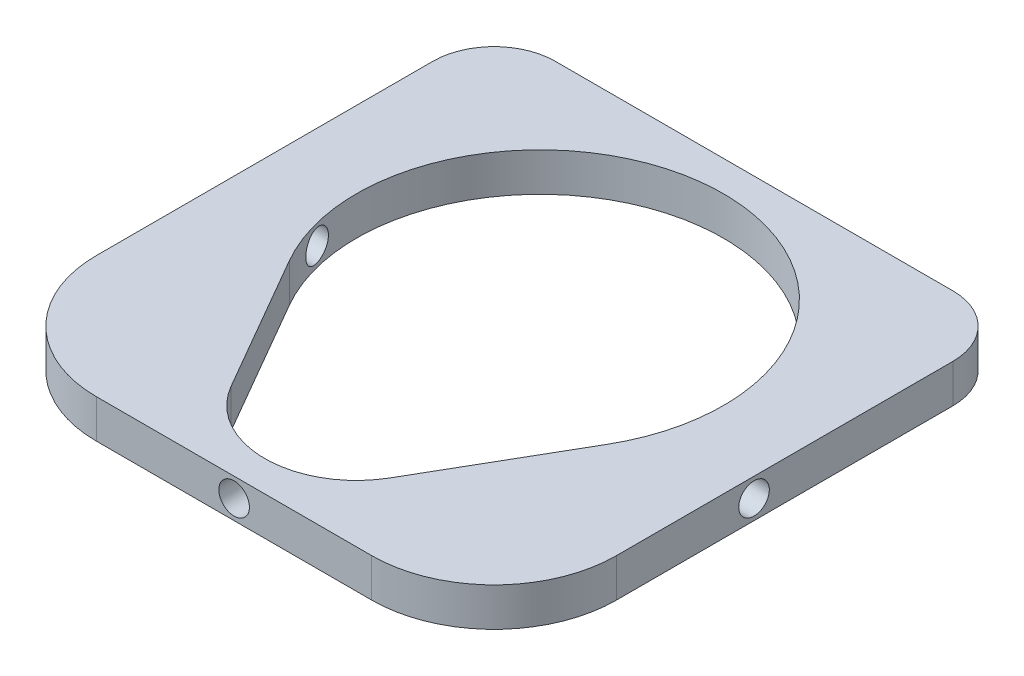
ISO-10303-21;
HEADER;
FILE_DESCRIPTION(('STEP AP214'),'2;1');
FILE_NAME('part.step','',(''),(''),'','','');
FILE_SCHEMA(('AUTOMOTIVE_DESIGN { 1 0 10303 214 1 1 1 1 }'));
ENDSEC;
DATA;
#1=APPLICATION_CONTEXT('core data for automotive mechanical design processes');
#2=APPLICATION_PROTOCOL_DEFINITION('international standard','automotive_design',2000,#1);
#3=PRODUCT_CONTEXT('',#1,'mechanical');
#4=PRODUCT('Part','Part','',(#3));
#5=PRODUCT_RELATED_PRODUCT_CATEGORY('part','',(#4));
#6=PRODUCT_DEFINITION_FORMATION('','',#4);
#7=PRODUCT_DEFINITION_CONTEXT('part definition',#1,'design');
#8=PRODUCT_DEFINITION('design','',#6,#7);
#9=PRODUCT_DEFINITION_SHAPE('','',#8);
#10=(LENGTH_UNIT() NAMED_UNIT(*) SI_UNIT(.MILLI.,.METRE.));
#11=(NAMED_UNIT(*) PLANE_ANGLE_UNIT() SI_UNIT($,.RADIAN.));
#12=(NAMED_UNIT(*) SI_UNIT($,.STERADIAN.) SOLID_ANGLE_UNIT());
#13=UNCERTAINTY_MEASURE_WITH_UNIT(LENGTH_MEASURE(1.E-05),#10,'distance_accuracy_value','');
#14=(GEOMETRIC_REPRESENTATION_CONTEXT(3) GLOBAL_UNCERTAINTY_ASSIGNED_CONTEXT((#13)) GLOBAL_UNIT_ASSIGNED_CONTEXT((#10,
#11,#12)) REPRESENTATION_CONTEXT('',''));
#15=CARTESIAN_POINT('',(0.,0.,0.));
#16=DIRECTION('',(0.,0.,1.));
#17=DIRECTION('',(1.,0.,0.));
#18=AXIS2_PLACEMENT_3D('',#15,#16,#17);
#19=CARTESIAN_POINT('',(0.,6.3,0.));
#20=DIRECTION('',(1.,0.,0.));
#21=DIRECTION('',(0.,0.,-1.));
#22=AXIS2_PLACEMENT_3D('',#19,#20,#21);
#23=PLANE('',#22);
#24=CARTESIAN_POINT('',(0.,3.15,-42.5));
#25=DIRECTION('',(-1.,0.,0.));
#26=DIRECTION('',(0.,0.,1.));
#27=AXIS2_PLACEMENT_3D('',#24,#25,#26);
#28=CIRCLE('',#27,2.5);
#29=CARTESIAN_POINT('',(0.,3.15,-40.));
#30=VERTEX_POINT('',#29);
#31=EDGE_CURVE('E223',#30,#30,#28,.T.);
#32=ORIENTED_EDGE('',*,*,#31,.F.);
#33=EDGE_LOOP('',(#32));
#34=FACE_BOUND('',#33,.T.);
#35=DIRECTION('',(0.,0.,1.));
#36=VECTOR('',#35,1.);
#37=CARTESIAN_POINT('',(0.,6.3,0.));
#38=LINE('',#37,#36);
#39=CARTESIAN_POINT('',(0.,6.3,-75.));
#40=VERTEX_POINT('',#39);
#41=CARTESIAN_POINT('',(0.,6.3,-20.));
#42=VERTEX_POINT('',#41);
#43=EDGE_CURVE('E160',#40,#42,#38,.T.);
#44=ORIENTED_EDGE('',*,*,#43,.F.);
#45=DIRECTION('',(0.,-1.,0.));
#46=VECTOR('',#45,1.);
#47=CARTESIAN_POINT('',(0.,6.3,-75.));
#48=LINE('',#47,#46);
#49=CARTESIAN_POINT('',(0.,0.,-75.));
#50=VERTEX_POINT('',#49);
#51=EDGE_CURVE('E11',#40,#50,#48,.T.);
#52=ORIENTED_EDGE('',*,*,#51,.T.);
#53=DIRECTION('',(0.,0.,1.));
#54=VECTOR('',#53,1.);
#55=CARTESIAN_POINT('',(0.,0.,0.));
#56=LINE('',#55,#54);
#57=CARTESIAN_POINT('',(0.,0.,-20.));
#58=VERTEX_POINT('',#57);
#59=EDGE_CURVE('E157',#50,#58,#56,.T.);
#60=ORIENTED_EDGE('',*,*,#59,.T.);
#61=DIRECTION('',(0.,-1.,0.));
#62=VECTOR('',#61,1.);
#63=CARTESIAN_POINT('',(0.,6.3,-20.));
#64=LINE('',#63,#62);
#65=EDGE_CURVE('E252',#58,#42,#64,.F.);
#66=ORIENTED_EDGE('',*,*,#65,.T.);
#67=EDGE_LOOP('',(#44,#52,#60,#66));
#68=FACE_BOUND('',#67,.T.);
#69=ADVANCED_FACE('F33',(#34,#68),#23,.F.);
#70=CARTESIAN_POINT('',(0.,6.3,0.));
#71=DIRECTION('',(0.,0.,-1.));
#72=DIRECTION('',(-1.,0.,0.));
#73=AXIS2_PLACEMENT_3D('',#70,#71,#72);
#74=PLANE('',#73);
#75=CARTESIAN_POINT('',(42.5,3.15,0.));
#76=DIRECTION('',(0.,0.,1.));
#77=DIRECTION('',(1.,0.,0.));
#78=AXIS2_PLACEMENT_3D('',#75,#76,#77);
#79=CIRCLE('',#78,2.5);
#80=CARTESIAN_POINT('',(45.,3.15,0.));
#81=VERTEX_POINT('',#80);
#82=EDGE_CURVE('E222',#81,#81,#79,.T.);
#83=ORIENTED_EDGE('',*,*,#82,.F.);
#84=EDGE_LOOP('',(#83));
#85=FACE_BOUND('',#84,.T.);
#86=DIRECTION('',(1.,0.,0.));
#87=VECTOR('',#86,1.);
#88=CARTESIAN_POINT('',(0.,0.,0.));
#89=LINE('',#88,#87);
#90=CARTESIAN_POINT('',(20.,0.,0.));
#91=VERTEX_POINT('',#90);
#92=CARTESIAN_POINT('',(65.,0.,0.));
#93=VERTEX_POINT('',#92);
#94=EDGE_CURVE('E172',#91,#93,#89,.T.);
#95=ORIENTED_EDGE('',*,*,#94,.T.);
#96=DIRECTION('',(0.,-1.,0.));
#97=VECTOR('',#96,1.);
#98=CARTESIAN_POINT('',(65.,6.3,0.));
#99=LINE('',#98,#97);
#100=CARTESIAN_POINT('',(65.,6.3,0.));
#101=VERTEX_POINT('',#100);
#102=EDGE_CURVE('E295',#93,#101,#99,.F.);
#103=ORIENTED_EDGE('',*,*,#102,.T.);
#104=DIRECTION('',(1.,0.,0.));
#105=VECTOR('',#104,1.);
#106=CARTESIAN_POINT('',(0.,6.3,0.));
#107=LINE('',#106,#105);
#108=CARTESIAN_POINT('',(20.,6.3,0.));
#109=VERTEX_POINT('',#108);
#110=EDGE_CURVE('E162',#109,#101,#107,.T.);
#111=ORIENTED_EDGE('',*,*,#110,.F.);
#112=DIRECTION('',(0.,-1.,0.));
#113=VECTOR('',#112,1.);
#114=CARTESIAN_POINT('',(20.,6.3,0.));
#115=LINE('',#114,#113);
#116=EDGE_CURVE('E301',#109,#91,#115,.T.);
#117=ORIENTED_EDGE('',*,*,#116,.T.);
#118=EDGE_LOOP('',(#95,#103,#111,#117));
#119=FACE_BOUND('',#118,.T.);
#120=ADVANCED_FACE('F275',(#85,#119),#74,.F.);
#121=CARTESIAN_POINT('',(85.,6.3,0.));
#122=DIRECTION('',(-1.,0.,0.));
#123=DIRECTION('',(0.,0.,1.));
#124=AXIS2_PLACEMENT_3D('',#121,#122,#123);
#125=PLANE('',#124);
#126=CARTESIAN_POINT('',(85.,3.15,-42.5));
#127=DIRECTION('',(-1.,0.,0.));
#128=DIRECTION('',(0.,0.,1.));
#129=AXIS2_PLACEMENT_3D('',#126,#127,#128);
#130=CIRCLE('',#129,2.5);
#131=CARTESIAN_POINT('',(85.,3.15,-40.));
#132=VERTEX_POINT('',#131);
#133=EDGE_CURVE('E194',#132,#132,#130,.T.);
#134=ORIENTED_EDGE('',*,*,#133,.T.);
#135=EDGE_LOOP('',(#134));
#136=FACE_BOUND('',#135,.T.);
#137=DIRECTION('',(0.,0.,-1.));
#138=VECTOR('',#137,1.);
#139=CARTESIAN_POINT('',(85.,0.,0.));
#140=LINE('',#139,#138);
#141=CARTESIAN_POINT('',(85.,0.,-20.));
#142=VERTEX_POINT('',#141);
#143=CARTESIAN_POINT('',(85.,0.,-75.));
#144=VERTEX_POINT('',#143);
#145=EDGE_CURVE('E175',#142,#144,#140,.T.);
#146=ORIENTED_EDGE('',*,*,#145,.T.);
#147=DIRECTION('',(0.,-1.,0.));
#148=VECTOR('',#147,1.);
#149=CARTESIAN_POINT('',(85.,6.3,-75.));
#150=LINE('',#149,#148);
#151=CARTESIAN_POINT('',(85.,6.3,-75.));
#152=VERTEX_POINT('',#151);
#153=EDGE_CURVE('E56',#144,#152,#150,.F.);
#154=ORIENTED_EDGE('',*,*,#153,.T.);
#155=DIRECTION('',(0.,0.,-1.));
#156=VECTOR('',#155,1.);
#157=CARTESIAN_POINT('',(85.,6.3,0.));
#158=LINE('',#157,#156);
#159=CARTESIAN_POINT('',(85.,6.3,-20.));
#160=VERTEX_POINT('',#159);
#161=EDGE_CURVE('E166',#160,#152,#158,.T.);
#162=ORIENTED_EDGE('',*,*,#161,.F.);
#163=DIRECTION('',(0.,-1.,0.));
#164=VECTOR('',#163,1.);
#165=CARTESIAN_POINT('',(85.,6.3,-20.));
#166=LINE('',#165,#164);
#167=EDGE_CURVE('E185',#160,#142,#166,.T.);
#168=ORIENTED_EDGE('',*,*,#167,.T.);
#169=EDGE_LOOP('',(#146,#154,#162,#168));
#170=FACE_BOUND('',#169,.T.);
#171=ADVANCED_FACE('F281',(#136,#170),#125,.F.);
#172=CARTESIAN_POINT('',(0.,6.3,-85.));
#173=DIRECTION('',(0.,0.,1.));
#174=DIRECTION('',(1.,0.,0.));
#175=AXIS2_PLACEMENT_3D('',#172,#173,#174);
#176=PLANE('',#175);
#177=DIRECTION('',(-1.,0.,0.));
#178=VECTOR('',#177,1.);
#179=CARTESIAN_POINT('',(0.,6.3,-85.));
#180=LINE('',#179,#178);
#181=CARTESIAN_POINT('',(75.,6.3,-85.));
#182=VERTEX_POINT('',#181);
#183=CARTESIAN_POINT('',(10.,6.3,-85.));
#184=VERTEX_POINT('',#183);
#185=EDGE_CURVE('E168',#182,#184,#180,.T.);
#186=ORIENTED_EDGE('',*,*,#185,.F.);
#187=DIRECTION('',(0.,-1.,0.));
#188=VECTOR('',#187,1.);
#189=CARTESIAN_POINT('',(75.,6.3,-85.));
#190=LINE('',#189,#188);
#191=CARTESIAN_POINT('',(75.,0.,-85.));
#192=VERTEX_POINT('',#191);
#193=EDGE_CURVE('E249',#182,#192,#190,.T.);
#194=ORIENTED_EDGE('',*,*,#193,.T.);
#195=DIRECTION('',(-1.,0.,0.));
#196=VECTOR('',#195,1.);
#197=CARTESIAN_POINT('',(0.,0.,-85.));
#198=LINE('',#197,#196);
#199=CARTESIAN_POINT('',(10.,0.,-85.));
#200=VERTEX_POINT('',#199);
#201=EDGE_CURVE('E163',#192,#200,#198,.T.);
#202=ORIENTED_EDGE('',*,*,#201,.T.);
#203=DIRECTION('',(0.,-1.,0.));
#204=VECTOR('',#203,1.);
#205=CARTESIAN_POINT('',(10.,6.3,-85.));
#206=LINE('',#205,#204);
#207=EDGE_CURVE('E247',#200,#184,#206,.F.);
#208=ORIENTED_EDGE('',*,*,#207,.T.);
#209=EDGE_LOOP('',(#186,#194,#202,#208));
#210=FACE_BOUND('',#209,.T.);
#211=ADVANCED_FACE('F246',(#210),#176,.F.);
#212=CARTESIAN_POINT('',(0.,6.3,0.));
#213=DIRECTION('',(0.,-1.,0.));
#214=DIRECTION('',(0.,0.,-1.));
#215=AXIS2_PLACEMENT_3D('',#212,#213,#214);
#216=PLANE('',#215);
#217=DIRECTION('',(0.5,0.,0.866025403784438));
#218=VECTOR('',#217,1.);
#219=CARTESIAN_POINT('',(16.5192378864669,6.3,-35.));
#220=LINE('',#219,#218);
#221=CARTESIAN_POINT('',(16.5192378864669,6.3,-35.));
#222=VERTEX_POINT('',#221);
#223=CARTESIAN_POINT('',(29.5096189432334,6.3,-12.5));
#224=VERTEX_POINT('',#223);
#225=EDGE_CURVE('E141',#222,#224,#220,.T.);
#226=ORIENTED_EDGE('',*,*,#225,.F.);
#227=CARTESIAN_POINT('',(42.5,6.3,-50.));
#228=DIRECTION('',(0.,1.,0.));
#229=DIRECTION('',(0.,0.,1.));
#230=AXIS2_PLACEMENT_3D('',#227,#228,#229);
#231=CIRCLE('',#230,30.);
#232=CARTESIAN_POINT('',(68.4807621135332,6.3,-35.));
#233=VERTEX_POINT('',#232);
#234=EDGE_CURVE('E146',#233,#222,#231,.T.);
#235=ORIENTED_EDGE('',*,*,#234,.F.);
#236=DIRECTION('',(0.5,0.,-0.866025403784439));
#237=VECTOR('',#236,1.);
#238=CARTESIAN_POINT('',(55.4903810567666,6.3,-12.5));
#239=LINE('',#238,#237);
#240=CARTESIAN_POINT('',(55.4903810567666,6.3,-12.5));
#241=VERTEX_POINT('',#240);
#242=EDGE_CURVE('E150',#241,#233,#239,.T.);
#243=ORIENTED_EDGE('',*,*,#242,.F.);
#244=CARTESIAN_POINT('',(42.5,6.3,-20.));
#245=DIRECTION('',(0.,1.,0.));
#246=DIRECTION('',(0.,0.,1.));
#247=AXIS2_PLACEMENT_3D('',#244,#245,#246);
#248=CIRCLE('',#247,15.);
#249=EDGE_CURVE('E130',#224,#241,#248,.T.);
#250=ORIENTED_EDGE('',*,*,#249,.F.);
#251=EDGE_LOOP('',(#226,#235,#243,#250));
#252=FACE_BOUND('',#251,.T.);
#253=ORIENTED_EDGE('',*,*,#161,.T.);
#254=CARTESIAN_POINT('',(75.,6.3,-75.));
#255=DIRECTION('',(0.,-1.,0.));
#256=DIRECTION('',(0.,0.,-1.));
#257=AXIS2_PLACEMENT_3D('',#254,#255,#256);
#258=CIRCLE('',#257,10.);
#259=EDGE_CURVE('E41',#152,#182,#258,.F.);
#260=ORIENTED_EDGE('',*,*,#259,.T.);
#261=ORIENTED_EDGE('',*,*,#185,.T.);
#262=CARTESIAN_POINT('',(10.,6.3,-75.));
#263=DIRECTION('',(0.,-1.,0.));
#264=DIRECTION('',(0.,0.,-1.));
#265=AXIS2_PLACEMENT_3D('',#262,#263,#264);
#266=CIRCLE('',#265,10.);
#267=EDGE_CURVE('E48',#184,#40,#266,.F.);
#268=ORIENTED_EDGE('',*,*,#267,.T.);
#269=ORIENTED_EDGE('',*,*,#43,.T.);
#270=CARTESIAN_POINT('',(20.,6.3,-20.));
#271=DIRECTION('',(0.,-1.,0.));
#272=DIRECTION('',(0.,0.,-1.));
#273=AXIS2_PLACEMENT_3D('',#270,#271,#272);
#274=CIRCLE('',#273,20.);
#275=EDGE_CURVE('E297',#42,#109,#274,.F.);
#276=ORIENTED_EDGE('',*,*,#275,.T.);
#277=ORIENTED_EDGE('',*,*,#110,.T.);
#278=CARTESIAN_POINT('',(65.,6.3,-20.));
#279=DIRECTION('',(0.,-1.,0.));
#280=DIRECTION('',(0.,0.,-1.));
#281=AXIS2_PLACEMENT_3D('',#278,#279,#280);
#282=CIRCLE('',#281,20.);
#283=EDGE_CURVE('E256',#101,#160,#282,.F.);
#284=ORIENTED_EDGE('',*,*,#283,.T.);
#285=EDGE_LOOP('',(#253,#260,#261,#268,#269,#276,#277,#284));
#286=FACE_BOUND('',#285,.T.);
#287=ADVANCED_FACE('F148',(#252,#286),#216,.F.);
#288=CARTESIAN_POINT('',(0.,0.,0.));
#289=DIRECTION('',(0.,-1.,0.));
#290=DIRECTION('',(0.,0.,-1.));
#291=AXIS2_PLACEMENT_3D('',#288,#289,#290);
#292=PLANE('',#291);
#293=CARTESIAN_POINT('',(42.5,0.,-50.));
#294=DIRECTION('',(0.,-1.,0.));
#295=DIRECTION('',(0.,0.,-1.));
#296=AXIS2_PLACEMENT_3D('',#293,#294,#295);
#297=CIRCLE('',#296,30.);
#298=CARTESIAN_POINT('',(16.5192378864669,0.,-35.));
#299=VERTEX_POINT('',#298);
#300=CARTESIAN_POINT('',(68.4807621135332,0.,-35.));
#301=VERTEX_POINT('',#300);
#302=EDGE_CURVE('E183',#299,#301,#297,.T.);
#303=ORIENTED_EDGE('',*,*,#302,.F.);
#304=DIRECTION('',(-0.5,0.,-0.866025403784438));
#305=VECTOR('',#304,1.);
#306=CARTESIAN_POINT('',(27.5448729810778,0.,-15.9030398304193));
#307=LINE('',#306,#305);
#308=CARTESIAN_POINT('',(29.5096189432334,0.,-12.5));
#309=VERTEX_POINT('',#308);
#310=EDGE_CURVE('E170',#309,#299,#307,.T.);
#311=ORIENTED_EDGE('',*,*,#310,.F.);
#312=CARTESIAN_POINT('',(42.5,0.,-20.));
#313=DIRECTION('',(0.,-1.,0.));
#314=DIRECTION('',(0.,0.,-1.));
#315=AXIS2_PLACEMENT_3D('',#312,#313,#314);
#316=CIRCLE('',#315,15.);
#317=CARTESIAN_POINT('',(55.4903810567666,0.,-12.5));
#318=VERTEX_POINT('',#317);
#319=EDGE_CURVE('E133',#318,#309,#316,.T.);
#320=ORIENTED_EDGE('',*,*,#319,.F.);
#321=DIRECTION('',(-0.5,0.,0.866025403784439));
#322=VECTOR('',#321,1.);
#323=CARTESIAN_POINT('',(36.2051270189222,0.,20.9030398304193));
#324=LINE('',#323,#322);
#325=EDGE_CURVE('E181',#301,#318,#324,.T.);
#326=ORIENTED_EDGE('',*,*,#325,.F.);
#327=EDGE_LOOP('',(#303,#311,#320,#326));
#328=FACE_BOUND('',#327,.T.);
#329=ORIENTED_EDGE('',*,*,#201,.F.);
#330=CARTESIAN_POINT('',(75.,0.,-75.));
#331=DIRECTION('',(0.,-1.,0.));
#332=DIRECTION('',(0.,0.,-1.));
#333=AXIS2_PLACEMENT_3D('',#330,#331,#332);
#334=CIRCLE('',#333,10.);
#335=EDGE_CURVE('E239',#192,#144,#334,.T.);
#336=ORIENTED_EDGE('',*,*,#335,.T.);
#337=ORIENTED_EDGE('',*,*,#145,.F.);
#338=CARTESIAN_POINT('',(65.,0.,-20.));
#339=DIRECTION('',(0.,-1.,0.));
#340=DIRECTION('',(0.,0.,-1.));
#341=AXIS2_PLACEMENT_3D('',#338,#339,#340);
#342=CIRCLE('',#341,20.);
#343=EDGE_CURVE('E304',#142,#93,#342,.T.);
#344=ORIENTED_EDGE('',*,*,#343,.T.);
#345=ORIENTED_EDGE('',*,*,#94,.F.);
#346=CARTESIAN_POINT('',(20.,0.,-20.));
#347=DIRECTION('',(0.,-1.,0.));
#348=DIRECTION('',(0.,0.,-1.));
#349=AXIS2_PLACEMENT_3D('',#346,#347,#348);
#350=CIRCLE('',#349,20.);
#351=EDGE_CURVE('E306',#91,#58,#350,.T.);
#352=ORIENTED_EDGE('',*,*,#351,.T.);
#353=ORIENTED_EDGE('',*,*,#59,.F.);
#354=CARTESIAN_POINT('',(10.,0.,-75.));
#355=DIRECTION('',(0.,-1.,0.));
#356=DIRECTION('',(0.,0.,-1.));
#357=AXIS2_PLACEMENT_3D('',#354,#355,#356);
#358=CIRCLE('',#357,10.);
#359=EDGE_CURVE('E241',#50,#200,#358,.T.);
#360=ORIENTED_EDGE('',*,*,#359,.T.);
#361=EDGE_LOOP('',(#329,#336,#337,#344,#345,#352,#353,#360));
#362=FACE_BOUND('',#361,.T.);
#363=ADVANCED_FACE('F233',(#328,#362),#292,.T.);
#364=CARTESIAN_POINT('',(42.5,-3.7,-50.));
#365=DIRECTION('',(0.,1.,0.));
#366=DIRECTION('',(0.,0.,1.));
#367=AXIS2_PLACEMENT_3D('',#364,#365,#366);
#368=CYLINDRICAL_SURFACE('',#367,30.);
#369=CARTESIAN_POINT('',(70.7842712474619,3.15,-40.));
#370=CARTESIAN_POINT('',(70.7842745461034,3.01507488080024,-40.0000068252859));
#371=CARTESIAN_POINT('',(70.7881572028325,2.88005304176365,-40.010970187135));
#372=CARTESIAN_POINT('',(70.8034667907939,2.61386486928332,-40.05443441423));
#373=CARTESIAN_POINT('',(70.8149026451648,2.4827032879119,-40.0869607535495));
#374=CARTESIAN_POINT('',(70.8446229802756,2.22825219517015,-40.172265301055));
#375=CARTESIAN_POINT('',(70.8628946791898,2.10494849142593,-40.2250057169516));
#376=CARTESIAN_POINT('',(70.9052974274408,1.86913969193915,-40.3489199253905));
#377=CARTESIAN_POINT('',(70.929427933106,1.7566335955769,-40.4200920075959));
#378=CARTESIAN_POINT('',(70.9831175332209,1.54203729667637,-40.5809034699253));
#379=CARTESIAN_POINT('',(71.0128094223934,1.44032576650629,-40.6710031145989));
#380=CARTESIAN_POINT('',(71.0757982686736,1.25328599559157,-40.8657666182573));
#381=CARTESIAN_POINT('',(71.1090961402248,1.16796192584034,-40.9704341734568));
#382=CARTESIAN_POINT('',(71.1797327108047,1.01157072987858,-41.1972883046544));
#383=CARTESIAN_POINT('',(71.2171911382768,0.941461891342386,-41.3200988478498));
#384=CARTESIAN_POINT('',(71.2931496512233,0.822959239517544,-41.575495220489));
#385=CARTESIAN_POINT('',(71.331649945415,0.774569811939291,-41.7080830179258));
#386=CARTESIAN_POINT('',(71.4095612799225,0.699560286502884,-41.9838654632819));
#387=CARTESIAN_POINT('',(71.4489629491476,0.673671599967631,-42.1272624533035));
#388=CARTESIAN_POINT('',(71.5261551959953,0.647158723226745,-42.4168106557994));
#389=CARTESIAN_POINT('',(71.5639457469174,0.646534951567005,-42.5629619138615));
#390=CARTESIAN_POINT('',(71.6367632085997,0.670845315417484,-42.8535722037818));
#391=CARTESIAN_POINT('',(71.6717947408371,0.695735689012401,-42.9980337047715));
#392=CARTESIAN_POINT('',(71.7382993289798,0.770663231515943,-43.2811459569061));
#393=CARTESIAN_POINT('',(71.7697728328125,0.820697230715486,-43.4197974380998));
#394=CARTESIAN_POINT('',(71.8278314205558,0.943283018164972,-43.6836609625199));
#395=CARTESIAN_POINT('',(71.8545158317984,1.01526457090408,-43.8091159580114));
#396=CARTESIAN_POINT('',(71.9035377415539,1.18026821196048,-44.0462909948082));
#397=CARTESIAN_POINT('',(71.925875891202,1.27328714404061,-44.1580130925825));
#398=CARTESIAN_POINT('',(71.9654988482725,1.47503812789215,-44.361308036007));
#399=CARTESIAN_POINT('',(71.9829020653827,1.58328748222718,-44.4533370531362));
#400=CARTESIAN_POINT('',(72.0133987448326,1.8142103325119,-44.6179626245817));
#401=CARTESIAN_POINT('',(72.0264926472972,1.93688235368796,-44.6905611632568));
#402=CARTESIAN_POINT('',(72.0482264107505,2.19080384738397,-44.8128885104504));
#403=CARTESIAN_POINT('',(72.0569410976265,2.3218627706266,-44.8629998344669));
#404=CARTESIAN_POINT('',(72.0703316482215,2.59070182826048,-44.9406470101779));
#405=CARTESIAN_POINT('',(72.0750077254907,2.72848160686483,-44.9681840555324));
#406=CARTESIAN_POINT('',(72.0803505911879,3.00561711707688,-44.999688434276));
#407=CARTESIAN_POINT('',(72.0810504965554,3.14495011723183,-45.0038504514417));
#408=CARTESIAN_POINT('',(72.0785384195417,3.42233808688244,-44.9890001387518));
#409=CARTESIAN_POINT('',(72.0753265238892,3.56039308464434,-44.9699883226837));
#410=CARTESIAN_POINT('',(72.0649640559923,3.83103158412566,-44.9094370802788));
#411=CARTESIAN_POINT('',(72.0578211532271,3.96362520139628,-44.8679415226318));
#412=CARTESIAN_POINT('',(72.03953686741,4.21989187947147,-44.7637280905939));
#413=CARTESIAN_POINT('',(72.0283954933311,4.3435649602938,-44.7010102638278));
#414=CARTESIAN_POINT('',(72.0020117746199,4.57894195698922,-44.5560377352079));
#415=CARTESIAN_POINT('',(71.9867562846353,4.6906058732126,-44.4737205101914));
#416=CARTESIAN_POINT('',(71.9521518116548,4.89847210381651,-44.2921746106501));
#417=CARTESIAN_POINT('',(71.9328027088349,4.99467396546233,-44.1929454411126));
#418=CARTESIAN_POINT('',(71.8898847272955,5.16999914028478,-43.979483232101));
#419=CARTESIAN_POINT('',(71.8662753316766,5.24894078738926,-43.8651092140288));
#420=CARTESIAN_POINT('',(71.8152077892079,5.38656415546631,-43.6255527243873));
#421=CARTESIAN_POINT('',(71.7877493293889,5.44524422761589,-43.5003693742243));
#422=CARTESIAN_POINT('',(71.728826213819,5.54198827943262,-43.24027949121));
#423=CARTESIAN_POINT('',(71.697294246441,5.57963080035531,-43.1052315656265));
#424=CARTESIAN_POINT('',(71.6312845173166,5.63184819445665,-42.831450923843));
#425=CARTESIAN_POINT('',(71.5968063343906,5.6464197636674,-42.6927176827647));
#426=CARTESIAN_POINT('',(71.5247746066406,5.65249361232225,-42.4115835061041));
#427=CARTESIAN_POINT('',(71.4871634637992,5.64336829586957,-42.2691837423156));
#428=CARTESIAN_POINT('',(71.410787166526,5.60118894181782,-41.9882842880793));
#429=CARTESIAN_POINT('',(71.372021830246,5.56813111421207,-41.8497852189638));
#430=CARTESIAN_POINT('',(71.2937329411524,5.4780275378508,-41.5773231612774));
#431=CARTESIAN_POINT('',(71.2542118648634,5.42046082419265,-41.4435313804317));
#432=CARTESIAN_POINT('',(71.1768035010083,5.28275866412667,-41.1875747558116));
#433=CARTESIAN_POINT('',(71.1389162742815,5.20262237813632,-41.0654103447988));
#434=CARTESIAN_POINT('',(71.0664854195684,5.02187002563787,-40.8364677355847));
#435=CARTESIAN_POINT('',(71.0319366308278,4.92128634008234,-40.7296656603204));
#436=CARTESIAN_POINT('',(70.9678322638095,4.70205040905946,-40.5346372360007));
#437=CARTESIAN_POINT('',(70.938276927601,4.5833972881639,-40.4464117874396));
#438=CARTESIAN_POINT('',(70.8867928223023,4.33584330121351,-40.2945265860438));
#439=CARTESIAN_POINT('',(70.8646286224412,4.20746232447987,-40.230099530682));
#440=CARTESIAN_POINT('',(70.8278712655554,3.94073502192031,-40.1240241510762));
#441=CARTESIAN_POINT('',(70.8132655444533,3.80240567166017,-40.0823380194546));
#442=CARTESIAN_POINT('',(70.7967381590342,3.57744224750926,-40.0353160391142));
#443=CARTESIAN_POINT('',(70.7920749535201,3.4925753810137,-40.0220952828788));
#444=CARTESIAN_POINT('',(70.785840498107,3.32181873028352,-40.0044352341134));
#445=CARTESIAN_POINT('',(70.7842691466752,3.23592897973242,-39.9999956532196));
#446=CARTESIAN_POINT('',(70.7842712474619,3.15,-40.));
#447=B_SPLINE_CURVE_WITH_KNOTS('',3,(#369,#370,#371,#372,#373,#374,#375,#376,#377,#378,#379,
#380,#381,#382,#383,#384,#385,#386,#387,#388,#389,#390,#391,#392,#393,#394,#395,#396,#397,#398,
#399,#400,#401,#402,#403,#404,#405,#406,#407,#408,#409,#410,#411,#412,#413,#414,#415,#416,#417,
#418,#419,#420,#421,#422,#423,#424,#425,#426,#427,#428,#429,#430,#431,#432,#433,#434,#435,#436,
#437,#438,#439,#440,#441,#442,#443,#444,#445,#446),.UNSPECIFIED.,.T.,.F.,(4,2,2,2,2,2,2,2,2,2,2,
2,2,2,2,2,2,2,2,2,2,2,2,2,2,2,2,2,2,2,2,2,2,2,2,2,2,2,4),(0.,0.40445064778418,0.809379959044663,
1.21355587748118,1.6176943044925,2.03312012772737,2.44865154686985,2.88554232746866,
3.32252128796277,3.77322393005451,4.2239340386136,4.67387237968031,5.1237540138888,
5.56282063561128,6.0018214278334,6.42916792174696,6.85647075576696,7.2762005266126,
7.69590810197519,8.11211481246918,8.52831229540397,8.94370063210939,9.35908803665075,
9.77581873586368,10.1925616348842,10.6134995952941,11.0344718022377,11.463600235411,
11.8927901180809,12.3334620093503,12.7742037016881,13.224822366363,13.6754577961556,
14.1253850725434,14.5753341539518,15.0091522729875,15.4422469428911,15.6998355450819,
15.9574156882186),.UNSPECIFIED.);
#448=CARTESIAN_POINT('',(70.7842712474619,3.15,-40.));
#449=VERTEX_POINT('',#448);
#450=EDGE_CURVE('E193',#449,#449,#447,.T.);
#451=ORIENTED_EDGE('',*,*,#450,.T.);
#452=EDGE_LOOP('',(#451));
#453=FACE_BOUND('',#452,.T.);
#454=CARTESIAN_POINT('',(14.2157287525381,3.15,-40.));
#455=CARTESIAN_POINT('',(14.2157254538966,3.28492511919976,-40.0000068252859));
#456=CARTESIAN_POINT('',(14.2118427971675,3.41994695823636,-40.010970187135));
#457=CARTESIAN_POINT('',(14.1965332092061,3.68613513071668,-40.05443441423));
#458=CARTESIAN_POINT('',(14.1850973548353,3.8172967120881,-40.0869607535495));
#459=CARTESIAN_POINT('',(14.1553770197244,4.07174780482985,-40.172265301055));
#460=CARTESIAN_POINT('',(14.1371053208102,4.19505150857408,-40.2250057169516));
#461=CARTESIAN_POINT('',(14.0947025725593,4.43086030806085,-40.3489199253905));
#462=CARTESIAN_POINT('',(14.0705720668941,4.54336640442311,-40.4200920075959));
#463=CARTESIAN_POINT('',(14.0168824667791,4.75796270332363,-40.5809034699253));
#464=CARTESIAN_POINT('',(13.9871905776066,4.85967423349372,-40.6710031145989));
#465=CARTESIAN_POINT('',(13.9242017313264,5.04671400440843,-40.8657666182573));
#466=CARTESIAN_POINT('',(13.8909038597752,5.13203807415966,-40.9704341734568));
#467=CARTESIAN_POINT('',(13.8202672891953,5.28842927012142,-41.1972883046544));
#468=CARTESIAN_POINT('',(13.7828088617232,5.35853810865762,-41.3200988478498));
#469=CARTESIAN_POINT('',(13.7068503487767,5.47704076048246,-41.575495220489));
#470=CARTESIAN_POINT('',(13.6683500545851,5.52543018806072,-41.7080830179258));
#471=CARTESIAN_POINT('',(13.5904387200775,5.60043971349712,-41.9838654632819));
#472=CARTESIAN_POINT('',(13.5510370508524,5.62632840003237,-42.1272624533035));
#473=CARTESIAN_POINT('',(13.4738448040047,5.65284127677326,-42.4168106557994));
#474=CARTESIAN_POINT('',(13.4360542530827,5.653465048433,-42.5629619138615));
#475=CARTESIAN_POINT('',(13.3632367914003,5.62915468458252,-42.8535722037818));
#476=CARTESIAN_POINT('',(13.328205259163,5.6042643109876,-42.9980337047715));
#477=CARTESIAN_POINT('',(13.2617006710202,5.52933676848406,-43.2811459569061));
#478=CARTESIAN_POINT('',(13.2302271671875,5.47930276928452,-43.4197974380998));
#479=CARTESIAN_POINT('',(13.1721685794442,5.35671698183503,-43.6836609625199));
#480=CARTESIAN_POINT('',(13.1454841682016,5.28473542909592,-43.8091159580114));
#481=CARTESIAN_POINT('',(13.0964622584461,5.11973178803952,-44.0462909948082));
#482=CARTESIAN_POINT('',(13.074124108798,5.0267128559594,-44.1580130925825));
#483=CARTESIAN_POINT('',(13.0345011517275,4.82496187210786,-44.361308036007));
#484=CARTESIAN_POINT('',(13.0170979346174,4.71671251777282,-44.4533370531361));
#485=CARTESIAN_POINT('',(12.9866012551674,4.48578966748811,-44.6179626245817));
#486=CARTESIAN_POINT('',(12.9735073527028,4.36311764631205,-44.6905611632568));
#487=CARTESIAN_POINT('',(12.9517735892495,4.10919615261604,-44.8128885104504));
#488=CARTESIAN_POINT('',(12.9430589023735,3.97813722937341,-44.8629998344669));
#489=CARTESIAN_POINT('',(12.9296683517785,3.70929817173953,-44.9406470101779));
#490=CARTESIAN_POINT('',(12.9249922745093,3.57151839313517,-44.9681840555324));
#491=CARTESIAN_POINT('',(12.9196494088122,3.29438288292312,-44.999688434276));
#492=CARTESIAN_POINT('',(12.9189495034447,3.15504988276817,-45.0038504514417));
#493=CARTESIAN_POINT('',(12.9214615804583,2.87766191311756,-44.9890001387518));
#494=CARTESIAN_POINT('',(12.9246734761108,2.73960691535566,-44.9699883226837));
#495=CARTESIAN_POINT('',(12.9350359440077,2.46896841587435,-44.9094370802788));
#496=CARTESIAN_POINT('',(12.942178846773,2.33637479860373,-44.8679415226318));
#497=CARTESIAN_POINT('',(12.9604631325901,2.08010812052854,-44.7637280905939));
#498=CARTESIAN_POINT('',(12.971604506669,1.95643503970621,-44.7010102638278));
#499=CARTESIAN_POINT('',(12.9979882253801,1.72105804301078,-44.5560377352079));
#500=CARTESIAN_POINT('',(13.0132437153648,1.6093941267874,-44.4737205101914));
#501=CARTESIAN_POINT('',(13.0478481883452,1.40152789618349,-44.2921746106501));
#502=CARTESIAN_POINT('',(13.0671972911651,1.30532603453767,-44.1929454411126));
#503=CARTESIAN_POINT('',(13.1101152727045,1.13000085971522,-43.979483232101));
#504=CARTESIAN_POINT('',(13.1337246683234,1.05105921261075,-43.8651092140288));
#505=CARTESIAN_POINT('',(13.1847922107922,0.913435844533693,-43.6255527243873));
#506=CARTESIAN_POINT('',(13.2122506706112,0.854755772384115,-43.5003693742243));
#507=CARTESIAN_POINT('',(13.271173786181,0.758011720567385,-43.24027949121));
#508=CARTESIAN_POINT('',(13.302705753559,0.720369199644693,-43.1052315656265));
#509=CARTESIAN_POINT('',(13.3687154826834,0.668151805543352,-42.831450923843));
#510=CARTESIAN_POINT('',(13.4031936656094,0.653580236332607,-42.6927176827647));
#511=CARTESIAN_POINT('',(13.4752253933594,0.647506387677755,-42.4115835061041));
#512=CARTESIAN_POINT('',(13.5128365362008,0.656631704130433,-42.2691837423156));
#513=CARTESIAN_POINT('',(13.589212833474,0.698811058182185,-41.9882842880793));
#514=CARTESIAN_POINT('',(13.6279781697541,0.731868885787933,-41.8497852189638));
#515=CARTESIAN_POINT('',(13.7062670588476,0.821972462149207,-41.5773231612774));
#516=CARTESIAN_POINT('',(13.7457881351366,0.879539175807353,-41.4435313804317));
#517=CARTESIAN_POINT('',(13.8231964989917,1.01724133587333,-41.1875747558116));
#518=CARTESIAN_POINT('',(13.8610837257185,1.09737762186368,-41.0654103447988));
#519=CARTESIAN_POINT('',(13.9335145804316,1.27812997436213,-40.8364677355847));
#520=CARTESIAN_POINT('',(13.9680633691722,1.37871365991766,-40.7296656603204));
#521=CARTESIAN_POINT('',(14.0321677361905,1.59794959094055,-40.5346372360007));
#522=CARTESIAN_POINT('',(14.061723072399,1.71660271183611,-40.4464117874396));
#523=CARTESIAN_POINT('',(14.1132071776977,1.9641566987865,-40.2945265860438));
#524=CARTESIAN_POINT('',(14.1353713775588,2.09253767552013,-40.230099530682));
#525=CARTESIAN_POINT('',(14.1721287344446,2.35926497807969,-40.1240241510762));
#526=CARTESIAN_POINT('',(14.1867344555467,2.49759432833983,-40.0823380194546));
#527=CARTESIAN_POINT('',(14.2032618409658,2.72255775249075,-40.0353160391142));
#528=CARTESIAN_POINT('',(14.20792504648,2.80742461898631,-40.0220952828788));
#529=CARTESIAN_POINT('',(14.214159501893,2.97818126971649,-40.0044352341134));
#530=CARTESIAN_POINT('',(14.2157308533248,3.06407102026758,-39.9999956532196));
#531=CARTESIAN_POINT('',(14.2157287525381,3.15,-40.));
#532=B_SPLINE_CURVE_WITH_KNOTS('',3,(#454,#455,#456,#457,#458,#459,#460,#461,#462,#463,#464,
#465,#466,#467,#468,#469,#470,#471,#472,#473,#474,#475,#476,#477,#478,#479,#480,#481,#482,#483,
#484,#485,#486,#487,#488,#489,#490,#491,#492,#493,#494,#495,#496,#497,#498,#499,#500,#501,#502,
#503,#504,#505,#506,#507,#508,#509,#510,#511,#512,#513,#514,#515,#516,#517,#518,#519,#520,#521,
#522,#523,#524,#525,#526,#527,#528,#529,#530,#531),.UNSPECIFIED.,.T.,.F.,(4,2,2,2,2,2,2,2,2,2,2,
2,2,2,2,2,2,2,2,2,2,2,2,2,2,2,2,2,2,2,2,2,2,2,2,2,2,2,4),(0.,0.404450647784179,
0.809379959044662,1.21355587748118,1.61769430449249,2.03312012772737,2.44865154686985,
2.88554232746866,3.32252128796278,3.77322393005451,4.2239340386136,4.67387237968031,
5.1237540138888,5.56282063561128,6.0018214278334,6.42916792174696,6.85647075576695,
7.2762005266126,7.69590810197519,8.11211481246918,8.52831229540396,8.94370063210939,
9.35908803665075,9.77581873586369,10.1925616348842,10.6134995952941,11.0344718022377,
11.463600235411,11.8927901180809,12.3334620093503,12.7742037016881,13.224822366363,
13.6754577961556,14.1253850725434,14.5753341539518,15.0091522729875,15.4422469428911,
15.6998355450819,15.9574156882186),.UNSPECIFIED.);
#533=CARTESIAN_POINT('',(14.2157287525381,3.15,-40.));
#534=VERTEX_POINT('',#533);
#535=EDGE_CURVE('E186',#534,#534,#532,.T.);
#536=ORIENTED_EDGE('',*,*,#535,.T.);
#537=EDGE_LOOP('',(#536));
#538=FACE_BOUND('',#537,.T.);
#539=ORIENTED_EDGE('',*,*,#302,.T.);
#540=DIRECTION('',(0.,1.,0.));
#541=VECTOR('',#540,1.);
#542=CARTESIAN_POINT('',(68.4807621135332,-3.7,-35.));
#543=LINE('',#542,#541);
#544=EDGE_CURVE('E155',#301,#233,#543,.T.);
#545=ORIENTED_EDGE('',*,*,#544,.T.);
#546=ORIENTED_EDGE('',*,*,#234,.T.);
#547=DIRECTION('',(0.,1.,0.));
#548=VECTOR('',#547,1.);
#549=CARTESIAN_POINT('',(16.5192378864669,-3.7,-35.));
#550=LINE('',#549,#548);
#551=EDGE_CURVE('E137',#299,#222,#550,.T.);
#552=ORIENTED_EDGE('',*,*,#551,.F.);
#553=EDGE_LOOP('',(#539,#545,#546,#552));
#554=FACE_BOUND('',#553,.T.);
#555=ADVANCED_FACE('F198',(#453,#538,#554),#368,.F.);
#556=CARTESIAN_POINT('',(55.4903810567666,-3.7,-12.5));
#557=DIRECTION('',(0.866025403784439,0.,0.5));
#558=DIRECTION('',(0.5,0.,-0.866025403784439));
#559=AXIS2_PLACEMENT_3D('',#556,#557,#558);
#560=PLANE('',#559);
#561=ORIENTED_EDGE('',*,*,#325,.T.);
#562=DIRECTION('',(0.,1.,0.));
#563=VECTOR('',#562,1.);
#564=CARTESIAN_POINT('',(55.4903810567666,-3.7,-12.5));
#565=LINE('',#564,#563);
#566=EDGE_CURVE('E136',#318,#241,#565,.T.);
#567=ORIENTED_EDGE('',*,*,#566,.T.);
#568=ORIENTED_EDGE('',*,*,#242,.T.);
#569=ORIENTED_EDGE('',*,*,#544,.F.);
#570=EDGE_LOOP('',(#561,#567,#568,#569));
#571=FACE_BOUND('',#570,.T.);
#572=ADVANCED_FACE('F231',(#571),#560,.F.);
#573=CARTESIAN_POINT('',(42.5,-3.7,-20.));
#574=DIRECTION('',(0.,1.,0.));
#575=DIRECTION('',(0.,0.,1.));
#576=AXIS2_PLACEMENT_3D('',#573,#574,#575);
#577=CYLINDRICAL_SURFACE('',#576,15.);
#578=CARTESIAN_POINT('',(45.,3.15,-5.20980054225097));
#579=CARTESIAN_POINT('',(44.9999943984198,3.01062425183819,-5.20979802633397));
#580=CARTESIAN_POINT('',(44.9883051690283,2.87117239392853,-5.20780907614766));
#581=CARTESIAN_POINT('',(44.9418774280664,2.59618145673683,-5.20007542799962));
#582=CARTESIAN_POINT('',(44.9071176603086,2.46064610624194,-5.1943272665363));
#583=CARTESIAN_POINT('',(44.8156295436705,2.1975077166584,-5.17974390632694));
#584=CARTESIAN_POINT('',(44.758919554932,2.06989815133776,-5.17091128815994));
#585=CARTESIAN_POINT('',(44.6251864968895,1.82601904528223,-5.15115727897716));
#586=CARTESIAN_POINT('',(44.5481657135013,1.70974823042267,-5.14023612305771));
#587=CARTESIAN_POINT('',(44.3751875269665,1.49068715025544,-5.1174152884412));
#588=CARTESIAN_POINT('',(44.2790690489323,1.38802486861379,-5.10550782672056));
#589=CARTESIAN_POINT('',(44.0709720046953,1.20020669313819,-5.08212519331421));
#590=CARTESIAN_POINT('',(43.95899249915,1.11505183688458,-5.07065004728266));
#591=CARTESIAN_POINT('',(43.7215228699484,0.964185432780726,-5.04934263017294));
#592=CARTESIAN_POINT('',(43.5959560814567,0.898592992268197,-5.0395205756766));
#593=CARTESIAN_POINT('',(43.3353956217239,0.789478929469448,-5.0227126304291));
#594=CARTESIAN_POINT('',(43.2004025640782,0.745955872115124,-5.01572655527343));
#595=CARTESIAN_POINT('',(42.9261437263442,0.6826074650161,-5.00543265275605));
#596=CARTESIAN_POINT('',(42.7869288866793,0.662567083995307,-5.00209146889092));
#597=CARTESIAN_POINT('',(42.5070752855258,0.646084245847402,-4.99934920657225));
#598=CARTESIAN_POINT('',(42.3664366214711,0.649640184752766,-4.99994786030693));
#599=CARTESIAN_POINT('',(42.0891978149211,0.68008135152821,-5.00499141568611));
#600=CARTESIAN_POINT('',(41.9525714692999,0.706735163409153,-5.00939816307604));
#601=CARTESIAN_POINT('',(41.6857580203882,0.782251074246492,-5.02152021228364));
#602=CARTESIAN_POINT('',(41.5555711133485,0.8311138495895,-5.0292356148679));
#603=CARTESIAN_POINT('',(41.3046438522174,0.949890640315318,-5.04717301488043));
#604=CARTESIAN_POINT('',(41.183949476981,1.01990001208244,-5.05740632673121));
#605=CARTESIAN_POINT('',(40.9559344701534,1.17891282263505,-5.07924261928504));
#606=CARTESIAN_POINT('',(40.8486149220841,1.26791779871081,-5.09084571080866));
#607=CARTESIAN_POINT('',(40.6490287265533,1.4636788066193,-5.11429731767404));
#608=CARTESIAN_POINT('',(40.5569604977468,1.57063709490098,-5.12614710268959));
#609=CARTESIAN_POINT('',(40.3920454115519,1.79858709021582,-5.14862040215195));
#610=CARTESIAN_POINT('',(40.3191987314676,1.91957892668282,-5.15924390528676));
#611=CARTESIAN_POINT('',(40.1947555655117,2.17239164187748,-5.17806245438185));
#612=CARTESIAN_POINT('',(40.1431829727208,2.30422449809209,-5.186254766974));
#613=CARTESIAN_POINT('',(40.0629701291844,2.57484907230754,-5.19923811310122));
#614=CARTESIAN_POINT('',(40.0343278592321,2.71364017643242,-5.2040294461168));
#615=CARTESIAN_POINT('',(40.0010681151207,2.99246615616213,-5.20961040577885));
#616=CARTESIAN_POINT('',(39.9961677920876,3.1324663797021,-5.21044714241332));
#617=CARTESIAN_POINT('',(40.0097772973175,3.41128667169082,-5.2081496521764));
#618=CARTESIAN_POINT('',(40.0282862213753,3.55010678551397,-5.20501557868148));
#619=CARTESIAN_POINT('',(40.0879476650719,3.82172775919086,-5.19517312544983));
#620=CARTESIAN_POINT('',(40.1289562093536,3.95456113987801,-5.18848748081653));
#621=CARTESIAN_POINT('',(40.2323018098077,4.21147016627949,-5.17231426994499));
#622=CARTESIAN_POINT('',(40.2946401418991,4.3355452875509,-5.16282653609422));
#623=CARTESIAN_POINT('',(40.4395433267708,4.57267459440611,-5.14200871602608));
#624=CARTESIAN_POINT('',(40.5222894358406,4.68561657275606,-5.13066244399654));
#625=CARTESIAN_POINT('',(40.705410534292,4.89611353269501,-5.10745333320135));
#626=CARTESIAN_POINT('',(40.805786763616,4.99366743110975,-5.0955904581467));
#627=CARTESIAN_POINT('',(41.0225719296712,5.17165189272871,-5.07253577881737));
#628=CARTESIAN_POINT('',(41.1391367466138,5.25189382628455,-5.06135223655329));
#629=CARTESIAN_POINT('',(41.3842565520507,5.39165532700489,-5.04104887567059));
#630=CARTESIAN_POINT('',(41.5128111525294,5.45117556447385,-5.03192899030024));
#631=CARTESIAN_POINT('',(41.7777009484987,5.54751058395487,-5.01681641830419));
#632=CARTESIAN_POINT('',(41.9139994373974,5.58442407573493,-5.01081015432383));
#633=CARTESIAN_POINT('',(42.1909692651258,5.63481559896383,-5.00254416830716));
#634=CARTESIAN_POINT('',(42.3316402431784,5.64829555873236,-5.0002841379981));
#635=CARTESIAN_POINT('',(42.6115412757737,5.6513818823122,-4.99976962112188));
#636=CARTESIAN_POINT('',(42.7507681606027,5.64127525394109,-5.0014669797581));
#637=CARTESIAN_POINT('',(43.0255119743147,5.59809607773058,-5.00857821612669));
#638=CARTESIAN_POINT('',(43.1610289239675,5.56502365849034,-5.01399207304817));
#639=CARTESIAN_POINT('',(43.4243964459185,5.47696183445635,-5.02793011172598));
#640=CARTESIAN_POINT('',(43.5522553721538,5.42199683178995,-5.03645082959125));
#641=CARTESIAN_POINT('',(43.7969804529822,5.29174206376942,-5.0556724312197));
#642=CARTESIAN_POINT('',(43.9138460861182,5.21645133493756,-5.06637341832586));
#643=CARTESIAN_POINT('',(44.1347129455264,5.04666490753951,-5.08892370383591));
#644=CARTESIAN_POINT('',(44.2385514306027,4.95195904524875,-5.10078475458881));
#645=CARTESIAN_POINT('',(44.4289638759509,4.74647169209619,-5.12423696685632));
#646=CARTESIAN_POINT('',(44.5155337867119,4.63568644108748,-5.13582806450491));
#647=CARTESIAN_POINT('',(44.6695142709109,4.40025467751039,-5.15751656466092));
#648=CARTESIAN_POINT('',(44.7367849890577,4.27551566023452,-5.16760282154219));
#649=CARTESIAN_POINT('',(44.8493145364043,4.01639076416186,-5.18500789908686));
#650=CARTESIAN_POINT('',(44.8945953552231,3.88201467732264,-5.19232948275123));
#651=CARTESIAN_POINT('',(44.9520260531274,3.64759623051262,-5.20175255143512));
#652=CARTESIAN_POINT('',(44.9699874176714,3.5489731920374,-5.20475376580535));
#653=CARTESIAN_POINT('',(44.9939762951813,3.35024651516306,-5.20877864711929));
#654=CARTESIAN_POINT('',(45.0000040247928,3.2501429036758,-5.20980234996312));
#655=CARTESIAN_POINT('',(45.,3.15,-5.20980054225097));
#656=B_SPLINE_CURVE_WITH_KNOTS('',3,(#578,#579,#580,#581,#582,#583,#584,#585,#586,#587,#588,
#589,#590,#591,#592,#593,#594,#595,#596,#597,#598,#599,#600,#601,#602,#603,#604,#605,#606,#607,
#608,#609,#610,#611,#612,#613,#614,#615,#616,#617,#618,#619,#620,#621,#622,#623,#624,#625,#626,
#627,#628,#629,#630,#631,#632,#633,#634,#635,#636,#637,#638,#639,#640,#641,#642,#643,#644,#645,
#646,#647,#648,#649,#650,#651,#652,#653,#654,#655),.UNSPECIFIED.,.T.,.F.,(4,2,2,2,2,2,2,2,2,2,2,
2,2,2,2,2,2,2,2,2,2,2,2,2,2,2,2,2,2,2,2,2,2,2,2,2,2,2,4),(0.,0.417761038927741,0.83590751996297,
1.25370499787519,1.67145547405274,2.09289159155715,2.51435267834447,2.93832980111435,
3.36227935111113,3.78231567472566,4.20232344652693,4.61817121164669,5.03403164249534,
5.45179604139425,5.86959426226764,6.29246123462124,6.71533210746019,7.13867662498604,
7.56198385938078,7.98023542420411,8.39847083413977,8.81406064635492,9.22967532293575,
9.64912342762703,10.0686010443069,10.4924411303538,10.916267504767,11.3382298441765,
11.7601574591235,12.1769777626592,12.5937957321883,13.0101503983246,13.4265248039234,
13.8476699746325,14.2689137888181,14.6931372761832,15.1169356674446,15.4171067054377,
15.7172722940182),.UNSPECIFIED.);
#657=CARTESIAN_POINT('',(45.,3.15,-5.20980054225097));
#658=VERTEX_POINT('',#657);
#659=EDGE_CURVE('E216',#658,#658,#656,.T.);
#660=ORIENTED_EDGE('',*,*,#659,.F.);
#661=EDGE_LOOP('',(#660));
#662=FACE_BOUND('',#661,.T.);
#663=ORIENTED_EDGE('',*,*,#319,.T.);
#664=DIRECTION('',(0.,1.,0.));
#665=VECTOR('',#664,1.);
#666=CARTESIAN_POINT('',(29.5096189432334,-3.7,-12.5));
#667=LINE('',#666,#665);
#668=EDGE_CURVE('E125',#309,#224,#667,.T.);
#669=ORIENTED_EDGE('',*,*,#668,.T.);
#670=ORIENTED_EDGE('',*,*,#249,.T.);
#671=ORIENTED_EDGE('',*,*,#566,.F.);
#672=EDGE_LOOP('',(#663,#669,#670,#671));
#673=FACE_BOUND('',#672,.T.);
#674=ADVANCED_FACE('F127',(#662,#673),#577,.F.);
#675=CARTESIAN_POINT('',(16.5192378864669,-3.7,-35.));
#676=DIRECTION('',(-0.866025403784438,0.,0.5));
#677=DIRECTION('',(0.5,0.,0.866025403784438));
#678=AXIS2_PLACEMENT_3D('',#675,#676,#677);
#679=PLANE('',#678);
#680=ORIENTED_EDGE('',*,*,#310,.T.);
#681=ORIENTED_EDGE('',*,*,#551,.T.);
#682=ORIENTED_EDGE('',*,*,#225,.T.);
#683=ORIENTED_EDGE('',*,*,#668,.F.);
#684=EDGE_LOOP('',(#680,#681,#682,#683));
#685=FACE_BOUND('',#684,.T.);
#686=ADVANCED_FACE('F142',(#685),#679,.F.);
#687=CARTESIAN_POINT('',(42.5,3.15,-85.001));
#688=DIRECTION('',(0.,0.,1.));
#689=DIRECTION('',(1.,0.,0.));
#690=AXIS2_PLACEMENT_3D('',#687,#688,#689);
#691=CYLINDRICAL_SURFACE('',#690,2.5);
#692=ORIENTED_EDGE('',*,*,#82,.T.);
#693=EDGE_LOOP('',(#692));
#694=FACE_BOUND('',#693,.T.);
#695=ORIENTED_EDGE('',*,*,#659,.T.);
#696=EDGE_LOOP('',(#695));
#697=FACE_BOUND('',#696,.T.);
#698=ADVANCED_FACE('F212',(#694,#697),#691,.F.);
#699=CARTESIAN_POINT('',(85.,3.15,-42.5));
#700=DIRECTION('',(-1.,0.,0.));
#701=DIRECTION('',(0.,0.,1.));
#702=AXIS2_PLACEMENT_3D('',#699,#700,#701);
#703=CYLINDRICAL_SURFACE('',#702,2.5);
#704=ORIENTED_EDGE('',*,*,#31,.T.);
#705=EDGE_LOOP('',(#704));
#706=FACE_BOUND('',#705,.T.);
#707=ORIENTED_EDGE('',*,*,#535,.F.);
#708=EDGE_LOOP('',(#707));
#709=FACE_BOUND('',#708,.T.);
#710=ADVANCED_FACE('F207',(#706,#709),#703,.F.);
#711=ORIENTED_EDGE('',*,*,#133,.F.);
#712=EDGE_LOOP('',(#711));
#713=FACE_BOUND('',#712,.T.);
#714=ORIENTED_EDGE('',*,*,#450,.F.);
#715=EDGE_LOOP('',(#714));
#716=FACE_BOUND('',#715,.T.);
#717=ADVANCED_FACE('F202',(#713,#716),#703,.F.);
#718=CARTESIAN_POINT('',(65.,6.3,-20.));
#719=DIRECTION('',(0.,-1.,0.));
#720=DIRECTION('',(0.,0.,-1.));
#721=AXIS2_PLACEMENT_3D('',#718,#719,#720);
#722=CYLINDRICAL_SURFACE('',#721,20.);
#723=ORIENTED_EDGE('',*,*,#283,.F.);
#724=ORIENTED_EDGE('',*,*,#102,.F.);
#725=ORIENTED_EDGE('',*,*,#343,.F.);
#726=ORIENTED_EDGE('',*,*,#167,.F.);
#727=EDGE_LOOP('',(#723,#724,#725,#726));
#728=FACE_BOUND('',#727,.T.);
#729=ADVANCED_FACE('F206',(#728),#722,.T.);
#730=CARTESIAN_POINT('',(20.,6.3,-20.));
#731=DIRECTION('',(0.,-1.,0.));
#732=DIRECTION('',(0.,0.,-1.));
#733=AXIS2_PLACEMENT_3D('',#730,#731,#732);
#734=CYLINDRICAL_SURFACE('',#733,20.);
#735=ORIENTED_EDGE('',*,*,#275,.F.);
#736=ORIENTED_EDGE('',*,*,#65,.F.);
#737=ORIENTED_EDGE('',*,*,#351,.F.);
#738=ORIENTED_EDGE('',*,*,#116,.F.);
#739=EDGE_LOOP('',(#735,#736,#737,#738));
#740=FACE_BOUND('',#739,.T.);
#741=ADVANCED_FACE('F267',(#740),#734,.T.);
#742=CARTESIAN_POINT('',(75.,6.3,-75.));
#743=DIRECTION('',(0.,-1.,0.));
#744=DIRECTION('',(0.,0.,-1.));
#745=AXIS2_PLACEMENT_3D('',#742,#743,#744);
#746=CYLINDRICAL_SURFACE('',#745,10.);
#747=ORIENTED_EDGE('',*,*,#259,.F.);
#748=ORIENTED_EDGE('',*,*,#153,.F.);
#749=ORIENTED_EDGE('',*,*,#335,.F.);
#750=ORIENTED_EDGE('',*,*,#193,.F.);
#751=EDGE_LOOP('',(#747,#748,#749,#750));
#752=FACE_BOUND('',#751,.T.);
#753=ADVANCED_FACE('F265',(#752),#746,.T.);
#754=CARTESIAN_POINT('',(10.,6.3,-75.));
#755=DIRECTION('',(0.,-1.,0.));
#756=DIRECTION('',(0.,0.,-1.));
#757=AXIS2_PLACEMENT_3D('',#754,#755,#756);
#758=CYLINDRICAL_SURFACE('',#757,10.);
#759=ORIENTED_EDGE('',*,*,#267,.F.);
#760=ORIENTED_EDGE('',*,*,#207,.F.);
#761=ORIENTED_EDGE('',*,*,#359,.F.);
#762=ORIENTED_EDGE('',*,*,#51,.F.);
#763=EDGE_LOOP('',(#759,#760,#761,#762));
#764=FACE_BOUND('',#763,.T.);
#765=ADVANCED_FACE('F35',(#764),#758,.T.);
#766=CLOSED_SHELL('',(#69,#120,#171,#211,#287,#363,#555,#572,#674,#686,#698,#710,#717,#729,#741,
#753,#765));
#767=MANIFOLD_SOLID_BREP('B2',#766);
#768=ADVANCED_BREP_SHAPE_REPRESENTATION('',(#18,#767),#14);
#769=SHAPE_DEFINITION_REPRESENTATION(#9,#768);
ENDSEC;
END-ISO-10303-21;
